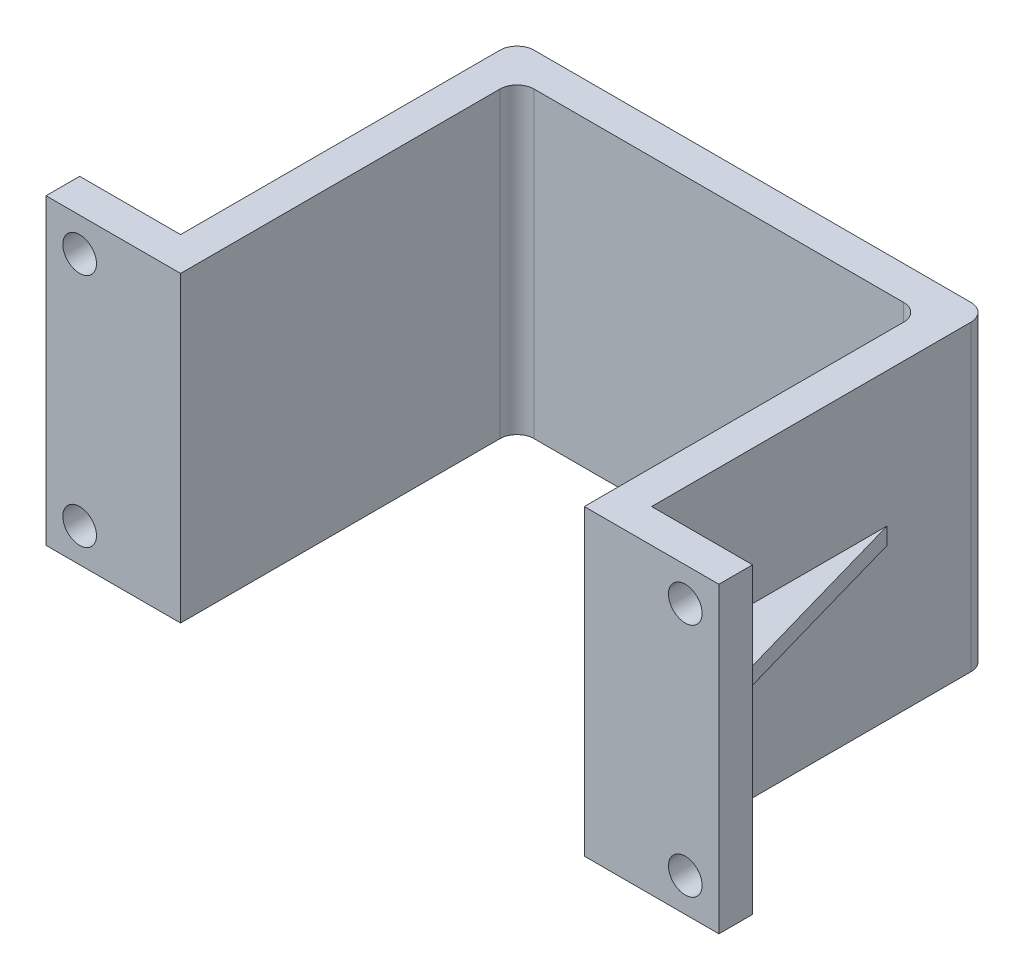
ISO-10303-21;
HEADER;
FILE_DESCRIPTION(('STEP AP214'),'2;1');
FILE_NAME('part.step','',(''),(''),'','','');
FILE_SCHEMA(('AUTOMOTIVE_DESIGN { 1 0 10303 214 1 1 1 1 }'));
ENDSEC;
DATA;
#1=APPLICATION_CONTEXT('core data for automotive mechanical design processes');
#2=APPLICATION_PROTOCOL_DEFINITION('international standard','automotive_design',2000,#1);
#3=PRODUCT_CONTEXT('',#1,'mechanical');
#4=PRODUCT('Part','Part','',(#3));
#5=PRODUCT_RELATED_PRODUCT_CATEGORY('part','',(#4));
#6=PRODUCT_DEFINITION_FORMATION('','',#4);
#7=PRODUCT_DEFINITION_CONTEXT('part definition',#1,'design');
#8=PRODUCT_DEFINITION('design','',#6,#7);
#9=PRODUCT_DEFINITION_SHAPE('','',#8);
#10=(LENGTH_UNIT() NAMED_UNIT(*) SI_UNIT(.MILLI.,.METRE.));
#11=(NAMED_UNIT(*) PLANE_ANGLE_UNIT() SI_UNIT($,.RADIAN.));
#12=(NAMED_UNIT(*) SI_UNIT($,.STERADIAN.) SOLID_ANGLE_UNIT());
#13=UNCERTAINTY_MEASURE_WITH_UNIT(LENGTH_MEASURE(1.E-05),#10,'distance_accuracy_value','');
#14=(GEOMETRIC_REPRESENTATION_CONTEXT(3) GLOBAL_UNCERTAINTY_ASSIGNED_CONTEXT((#13)) GLOBAL_UNIT_ASSIGNED_CONTEXT((#10,
#11,#12)) REPRESENTATION_CONTEXT('',''));
#15=CARTESIAN_POINT('',(0.,0.,0.));
#16=DIRECTION('',(0.,0.,1.));
#17=DIRECTION('',(1.,0.,0.));
#18=AXIS2_PLACEMENT_3D('',#15,#16,#17);
#19=CARTESIAN_POINT('',(13.,9.,-1.508));
#20=DIRECTION('',(-1.,0.,0.));
#21=DIRECTION('',(0.,0.,1.));
#22=AXIS2_PLACEMENT_3D('',#19,#20,#21);
#23=PLANE('',#22);
#24=DIRECTION('',(0.,0.,1.));
#25=VECTOR('',#24,1.);
#26=CARTESIAN_POINT('',(13.,5.00000011,-8.));
#27=LINE('',#26,#25);
#28=CARTESIAN_POINT('',(13.,5.00000011,-8.));
#29=VERTEX_POINT('',#28);
#30=CARTESIAN_POINT('',(13.,5.00000011,-1.));
#31=VERTEX_POINT('',#30);
#32=EDGE_CURVE('E193',#29,#31,#27,.T.);
#33=ORIENTED_EDGE('',*,*,#32,.F.);
#34=DIRECTION('',(0.,-1.,0.));
#35=VECTOR('',#34,1.);
#36=CARTESIAN_POINT('',(13.,5.00000011,-8.));
#37=LINE('',#36,#35);
#38=CARTESIAN_POINT('',(13.,4.50000011,-8.));
#39=VERTEX_POINT('',#38);
#40=EDGE_CURVE('E202',#29,#39,#37,.T.);
#41=ORIENTED_EDGE('',*,*,#40,.T.);
#42=DIRECTION('',(0.,0.,1.));
#43=VECTOR('',#42,1.);
#44=CARTESIAN_POINT('',(13.,4.50000011,-8.));
#45=LINE('',#44,#43);
#46=CARTESIAN_POINT('',(13.,4.50000011,-1.));
#47=VERTEX_POINT('',#46);
#48=EDGE_CURVE('E218',#39,#47,#45,.T.);
#49=ORIENTED_EDGE('',*,*,#48,.T.);
#50=DIRECTION('',(0.,-1.,0.));
#51=VECTOR('',#50,1.);
#52=CARTESIAN_POINT('',(13.,9.,-1.));
#53=LINE('',#52,#51);
#54=CARTESIAN_POINT('',(13.,0.,-1.));
#55=VERTEX_POINT('',#54);
#56=EDGE_CURVE('E48',#47,#55,#53,.T.);
#57=ORIENTED_EDGE('',*,*,#56,.T.);
#58=DIRECTION('',(0.,0.,-1.));
#59=VECTOR('',#58,1.);
#60=CARTESIAN_POINT('',(13.,0.,-1.508));
#61=LINE('',#60,#59);
#62=CARTESIAN_POINT('',(13.,0.,-10.492));
#63=VERTEX_POINT('',#62);
#64=EDGE_CURVE('E328',#55,#63,#61,.T.);
#65=ORIENTED_EDGE('',*,*,#64,.T.);
#66=DIRECTION('',(0.,-1.,0.));
#67=VECTOR('',#66,1.);
#68=CARTESIAN_POINT('',(13.,9.,-10.492));
#69=LINE('',#68,#67);
#70=CARTESIAN_POINT('',(13.,9.,-10.492));
#71=VERTEX_POINT('',#70);
#72=EDGE_CURVE('E438',#71,#63,#69,.T.);
#73=ORIENTED_EDGE('',*,*,#72,.F.);
#74=DIRECTION('',(0.,0.,-1.));
#75=VECTOR('',#74,1.);
#76=CARTESIAN_POINT('',(13.,9.,-1.508));
#77=LINE('',#76,#75);
#78=CARTESIAN_POINT('',(13.,9.,-1.));
#79=VERTEX_POINT('',#78);
#80=EDGE_CURVE('E280',#79,#71,#77,.T.);
#81=ORIENTED_EDGE('',*,*,#80,.F.);
#82=EDGE_CURVE('E11',#79,#31,#53,.T.);
#83=ORIENTED_EDGE('',*,*,#82,.T.);
#84=EDGE_LOOP('',(#33,#41,#49,#57,#65,#73,#81,#83));
#85=FACE_BOUND('',#84,.T.);
#86=ADVANCED_FACE('F39',(#85),#23,.F.);
#87=CARTESIAN_POINT('',(13.508,9.,-1.));
#88=DIRECTION('',(0.,0.,1.));
#89=DIRECTION('',(1.,0.,0.));
#90=AXIS2_PLACEMENT_3D('',#87,#88,#89);
#91=PLANE('',#90);
#92=CARTESIAN_POINT('',(15.,8.,-1.));
#93=DIRECTION('',(0.,0.,-1.));
#94=DIRECTION('',(-1.,0.,0.));
#95=AXIS2_PLACEMENT_3D('',#92,#93,#94);
#96=CIRCLE('',#95,0.500000000000001);
#97=CARTESIAN_POINT('',(14.5,8.,-1.));
#98=VERTEX_POINT('',#97);
#99=EDGE_CURVE('E251',#98,#98,#96,.T.);
#100=ORIENTED_EDGE('',*,*,#99,.F.);
#101=EDGE_LOOP('',(#100));
#102=FACE_BOUND('',#101,.T.);
#103=CARTESIAN_POINT('',(15.,0.999999999999999,-1.));
#104=DIRECTION('',(0.,0.,-1.));
#105=DIRECTION('',(-1.,0.,0.));
#106=AXIS2_PLACEMENT_3D('',#103,#104,#105);
#107=CIRCLE('',#106,0.500000000000001);
#108=CARTESIAN_POINT('',(14.5,0.999999999999999,-1.));
#109=VERTEX_POINT('',#108);
#110=EDGE_CURVE('E255',#109,#109,#107,.T.);
#111=ORIENTED_EDGE('',*,*,#110,.F.);
#112=EDGE_LOOP('',(#111));
#113=FACE_BOUND('',#112,.T.);
#114=DIRECTION('',(1.,0.,0.));
#115=VECTOR('',#114,1.);
#116=CARTESIAN_POINT('',(13.,5.00000011,-1.));
#117=LINE('',#116,#115);
#118=CARTESIAN_POINT('',(15.,5.00000011,-1.));
#119=VERTEX_POINT('',#118);
#120=EDGE_CURVE('E195',#31,#119,#117,.T.);
#121=ORIENTED_EDGE('',*,*,#120,.F.);
#122=ORIENTED_EDGE('',*,*,#82,.F.);
#123=DIRECTION('',(-1.,0.,0.));
#124=VECTOR('',#123,1.);
#125=CARTESIAN_POINT('',(13.,9.,-1.));
#126=LINE('',#125,#124);
#127=CARTESIAN_POINT('',(16.,9.,-1.));
#128=VERTEX_POINT('',#127);
#129=EDGE_CURVE('E276',#128,#79,#126,.T.);
#130=ORIENTED_EDGE('',*,*,#129,.F.);
#131=DIRECTION('',(0.,-1.,0.));
#132=VECTOR('',#131,1.);
#133=CARTESIAN_POINT('',(16.,9.,-1.));
#134=LINE('',#133,#132);
#135=CARTESIAN_POINT('',(16.,0.,-1.));
#136=VERTEX_POINT('',#135);
#137=EDGE_CURVE('E327',#128,#136,#134,.T.);
#138=ORIENTED_EDGE('',*,*,#137,.T.);
#139=DIRECTION('',(-1.,0.,0.));
#140=VECTOR('',#139,1.);
#141=CARTESIAN_POINT('',(13.508,0.,-1.));
#142=LINE('',#141,#140);
#143=EDGE_CURVE('E281',#136,#55,#142,.T.);
#144=ORIENTED_EDGE('',*,*,#143,.T.);
#145=ORIENTED_EDGE('',*,*,#56,.F.);
#146=DIRECTION('',(1.,0.,0.));
#147=VECTOR('',#146,1.);
#148=CARTESIAN_POINT('',(13.,4.50000011,-1.));
#149=LINE('',#148,#147);
#150=CARTESIAN_POINT('',(15.,4.50000011,-1.));
#151=VERTEX_POINT('',#150);
#152=EDGE_CURVE('E199',#47,#151,#149,.T.);
#153=ORIENTED_EDGE('',*,*,#152,.T.);
#154=DIRECTION('',(0.,-1.,0.));
#155=VECTOR('',#154,1.);
#156=CARTESIAN_POINT('',(15.,5.00000011,-1.));
#157=LINE('',#156,#155);
#158=EDGE_CURVE('E208',#119,#151,#157,.T.);
#159=ORIENTED_EDGE('',*,*,#158,.F.);
#160=EDGE_LOOP('',(#121,#122,#130,#138,#144,#145,#153,#159));
#161=FACE_BOUND('',#160,.T.);
#162=ADVANCED_FACE('F470',(#102,#113,#161),#91,.F.);
#163=CARTESIAN_POINT('',(12.492,9.,-10.492));
#164=DIRECTION('',(0.,-1.,0.));
#165=DIRECTION('',(0.,0.,-1.));
#166=AXIS2_PLACEMENT_3D('',#163,#164,#165);
#167=CYLINDRICAL_SURFACE('',#166,0.508);
#168=CARTESIAN_POINT('',(12.492,0.,-10.492));
#169=DIRECTION('',(0.,1.,0.));
#170=DIRECTION('',(0.,0.,-1.));
#171=AXIS2_PLACEMENT_3D('',#168,#169,#170);
#172=CIRCLE('',#171,0.508);
#173=CARTESIAN_POINT('',(12.492,0.,-11.));
#174=VERTEX_POINT('',#173);
#175=EDGE_CURVE('E331',#63,#174,#172,.T.);
#176=ORIENTED_EDGE('',*,*,#175,.T.);
#177=DIRECTION('',(0.,-1.,0.));
#178=VECTOR('',#177,1.);
#179=CARTESIAN_POINT('',(12.492,9.,-11.));
#180=LINE('',#179,#178);
#181=CARTESIAN_POINT('',(12.492,9.,-11.));
#182=VERTEX_POINT('',#181);
#183=EDGE_CURVE('E434',#182,#174,#180,.T.);
#184=ORIENTED_EDGE('',*,*,#183,.F.);
#185=CARTESIAN_POINT('',(12.492,9.,-10.492));
#186=DIRECTION('',(0.,1.,0.));
#187=DIRECTION('',(0.,0.,-1.));
#188=AXIS2_PLACEMENT_3D('',#185,#186,#187);
#189=CIRCLE('',#188,0.508);
#190=EDGE_CURVE('E284',#71,#182,#189,.T.);
#191=ORIENTED_EDGE('',*,*,#190,.F.);
#192=ORIENTED_EDGE('',*,*,#72,.T.);
#193=EDGE_LOOP('',(#176,#184,#191,#192));
#194=FACE_BOUND('',#193,.T.);
#195=ADVANCED_FACE('F474',(#194),#167,.T.);
#196=CARTESIAN_POINT('',(-0.491999999999997,9.,-11.));
#197=DIRECTION('',(0.,0.,1.));
#198=DIRECTION('',(1.,0.,0.));
#199=AXIS2_PLACEMENT_3D('',#196,#197,#198);
#200=PLANE('',#199);
#201=DIRECTION('',(-1.,0.,0.));
#202=VECTOR('',#201,1.);
#203=CARTESIAN_POINT('',(-0.491999999999997,0.,-11.));
#204=LINE('',#203,#202);
#205=CARTESIAN_POINT('',(-0.491999999999997,0.,-11.));
#206=VERTEX_POINT('',#205);
#207=EDGE_CURVE('E334',#174,#206,#204,.T.);
#208=ORIENTED_EDGE('',*,*,#207,.T.);
#209=DIRECTION('',(0.,-1.,0.));
#210=VECTOR('',#209,1.);
#211=CARTESIAN_POINT('',(-0.491999999999997,9.,-11.));
#212=LINE('',#211,#210);
#213=CARTESIAN_POINT('',(-0.491999999999997,9.,-11.));
#214=VERTEX_POINT('',#213);
#215=EDGE_CURVE('E430',#214,#206,#212,.T.);
#216=ORIENTED_EDGE('',*,*,#215,.F.);
#217=DIRECTION('',(-1.,0.,0.));
#218=VECTOR('',#217,1.);
#219=CARTESIAN_POINT('',(-0.491999999999997,9.,-11.));
#220=LINE('',#219,#218);
#221=EDGE_CURVE('E287',#182,#214,#220,.T.);
#222=ORIENTED_EDGE('',*,*,#221,.F.);
#223=ORIENTED_EDGE('',*,*,#183,.T.);
#224=EDGE_LOOP('',(#208,#216,#222,#223));
#225=FACE_BOUND('',#224,.T.);
#226=ADVANCED_FACE('F480',(#225),#200,.F.);
#227=CARTESIAN_POINT('',(-0.492,9.,-10.492));
#228=DIRECTION('',(0.,-1.,0.));
#229=DIRECTION('',(0.,0.,-1.));
#230=AXIS2_PLACEMENT_3D('',#227,#228,#229);
#231=CYLINDRICAL_SURFACE('',#230,0.508);
#232=CARTESIAN_POINT('',(-0.492,0.,-10.492));
#233=DIRECTION('',(0.,1.,0.));
#234=DIRECTION('',(0.,0.,-1.));
#235=AXIS2_PLACEMENT_3D('',#232,#233,#234);
#236=CIRCLE('',#235,0.508);
#237=CARTESIAN_POINT('',(-1.,0.,-10.492));
#238=VERTEX_POINT('',#237);
#239=EDGE_CURVE('E337',#206,#238,#236,.T.);
#240=ORIENTED_EDGE('',*,*,#239,.T.);
#241=DIRECTION('',(0.,-1.,0.));
#242=VECTOR('',#241,1.);
#243=CARTESIAN_POINT('',(-1.,9.,-10.492));
#244=LINE('',#243,#242);
#245=CARTESIAN_POINT('',(-1.,9.,-10.492));
#246=VERTEX_POINT('',#245);
#247=EDGE_CURVE('E426',#246,#238,#244,.T.);
#248=ORIENTED_EDGE('',*,*,#247,.F.);
#249=CARTESIAN_POINT('',(-0.492,9.,-10.492));
#250=DIRECTION('',(0.,1.,0.));
#251=DIRECTION('',(0.,0.,-1.));
#252=AXIS2_PLACEMENT_3D('',#249,#250,#251);
#253=CIRCLE('',#252,0.508);
#254=EDGE_CURVE('E290',#214,#246,#253,.T.);
#255=ORIENTED_EDGE('',*,*,#254,.F.);
#256=ORIENTED_EDGE('',*,*,#215,.T.);
#257=EDGE_LOOP('',(#240,#248,#255,#256));
#258=FACE_BOUND('',#257,.T.);
#259=ADVANCED_FACE('F530',(#258),#231,.T.);
#260=CARTESIAN_POINT('',(-1.,9.,-1.508));
#261=DIRECTION('',(1.,0.,0.));
#262=DIRECTION('',(0.,0.,-1.));
#263=AXIS2_PLACEMENT_3D('',#260,#261,#262);
#264=PLANE('',#263);
#265=DIRECTION('',(0.,-1.,0.));
#266=VECTOR('',#265,1.);
#267=CARTESIAN_POINT('',(-1.,5.00000011,-8.));
#268=LINE('',#267,#266);
#269=CARTESIAN_POINT('',(-1.,5.00000011,-8.));
#270=VERTEX_POINT('',#269);
#271=CARTESIAN_POINT('',(-1.,4.50000011,-8.));
#272=VERTEX_POINT('',#271);
#273=EDGE_CURVE('E64',#270,#272,#268,.T.);
#274=ORIENTED_EDGE('',*,*,#273,.F.);
#275=DIRECTION('',(0.,0.,-1.));
#276=VECTOR('',#275,1.);
#277=CARTESIAN_POINT('',(-1.,5.00000011,-8.));
#278=LINE('',#277,#276);
#279=CARTESIAN_POINT('',(-1.,5.00000011,-1.));
#280=VERTEX_POINT('',#279);
#281=EDGE_CURVE('E230',#280,#270,#278,.T.);
#282=ORIENTED_EDGE('',*,*,#281,.F.);
#283=DIRECTION('',(0.,-1.,0.));
#284=VECTOR('',#283,1.);
#285=CARTESIAN_POINT('',(-1.,9.,-1.));
#286=LINE('',#285,#284);
#287=CARTESIAN_POINT('',(-1.,9.,-1.));
#288=VERTEX_POINT('',#287);
#289=EDGE_CURVE('E422',#288,#280,#286,.T.);
#290=ORIENTED_EDGE('',*,*,#289,.F.);
#291=DIRECTION('',(0.,0.,1.));
#292=VECTOR('',#291,1.);
#293=CARTESIAN_POINT('',(-1.,9.,-1.508));
#294=LINE('',#293,#292);
#295=EDGE_CURVE('E293',#246,#288,#294,.T.);
#296=ORIENTED_EDGE('',*,*,#295,.F.);
#297=ORIENTED_EDGE('',*,*,#247,.T.);
#298=DIRECTION('',(0.,0.,1.));
#299=VECTOR('',#298,1.);
#300=CARTESIAN_POINT('',(-1.,0.,-1.508));
#301=LINE('',#300,#299);
#302=CARTESIAN_POINT('',(-1.,0.,-1.));
#303=VERTEX_POINT('',#302);
#304=EDGE_CURVE('E341',#238,#303,#301,.T.);
#305=ORIENTED_EDGE('',*,*,#304,.T.);
#306=CARTESIAN_POINT('',(-1.,4.50000011,-1.));
#307=VERTEX_POINT('',#306);
#308=EDGE_CURVE('E421',#307,#303,#286,.T.);
#309=ORIENTED_EDGE('',*,*,#308,.F.);
#310=DIRECTION('',(0.,0.,-1.));
#311=VECTOR('',#310,1.);
#312=CARTESIAN_POINT('',(-1.,4.50000011,-8.));
#313=LINE('',#312,#311);
#314=EDGE_CURVE('E241',#307,#272,#313,.T.);
#315=ORIENTED_EDGE('',*,*,#314,.T.);
#316=EDGE_LOOP('',(#274,#282,#290,#296,#297,#305,#309,#315));
#317=FACE_BOUND('',#316,.T.);
#318=ADVANCED_FACE('F526',(#317),#264,.F.);
#319=CARTESIAN_POINT('',(-1.508,9.,-1.));
#320=DIRECTION('',(0.,0.,1.));
#321=DIRECTION('',(1.,0.,0.));
#322=AXIS2_PLACEMENT_3D('',#319,#320,#321);
#323=PLANE('',#322);
#324=CARTESIAN_POINT('',(-3.,8.,-1.));
#325=DIRECTION('',(0.,0.,-1.));
#326=DIRECTION('',(-1.,0.,0.));
#327=AXIS2_PLACEMENT_3D('',#324,#325,#326);
#328=CIRCLE('',#327,0.5);
#329=CARTESIAN_POINT('',(-3.5,8.,-1.));
#330=VERTEX_POINT('',#329);
#331=EDGE_CURVE('E256',#330,#330,#328,.T.);
#332=ORIENTED_EDGE('',*,*,#331,.F.);
#333=EDGE_LOOP('',(#332));
#334=FACE_BOUND('',#333,.T.);
#335=CARTESIAN_POINT('',(-3.,0.999999999999999,-1.));
#336=DIRECTION('',(0.,0.,-1.));
#337=DIRECTION('',(-1.,0.,0.));
#338=AXIS2_PLACEMENT_3D('',#335,#336,#337);
#339=CIRCLE('',#338,0.5);
#340=CARTESIAN_POINT('',(-3.5,0.999999999999999,-1.));
#341=VERTEX_POINT('',#340);
#342=EDGE_CURVE('E260',#341,#341,#339,.T.);
#343=ORIENTED_EDGE('',*,*,#342,.F.);
#344=EDGE_LOOP('',(#343));
#345=FACE_BOUND('',#344,.T.);
#346=ORIENTED_EDGE('',*,*,#289,.T.);
#347=DIRECTION('',(1.,0.,0.));
#348=VECTOR('',#347,1.);
#349=CARTESIAN_POINT('',(-1.,5.00000011,-1.));
#350=LINE('',#349,#348);
#351=CARTESIAN_POINT('',(-3.,5.00000011,-1.));
#352=VERTEX_POINT('',#351);
#353=EDGE_CURVE('E226',#352,#280,#350,.T.);
#354=ORIENTED_EDGE('',*,*,#353,.F.);
#355=DIRECTION('',(0.,-1.,0.));
#356=VECTOR('',#355,1.);
#357=CARTESIAN_POINT('',(-3.,5.00000011,-1.));
#358=LINE('',#357,#356);
#359=CARTESIAN_POINT('',(-3.,4.50000011,-1.));
#360=VERTEX_POINT('',#359);
#361=EDGE_CURVE('E238',#352,#360,#358,.T.);
#362=ORIENTED_EDGE('',*,*,#361,.T.);
#363=DIRECTION('',(1.,0.,0.));
#364=VECTOR('',#363,1.);
#365=CARTESIAN_POINT('',(-1.,4.50000011,-1.));
#366=LINE('',#365,#364);
#367=EDGE_CURVE('E207',#360,#307,#366,.T.);
#368=ORIENTED_EDGE('',*,*,#367,.T.);
#369=ORIENTED_EDGE('',*,*,#308,.T.);
#370=DIRECTION('',(-1.,0.,0.));
#371=VECTOR('',#370,1.);
#372=CARTESIAN_POINT('',(-1.508,0.,-1.));
#373=LINE('',#372,#371);
#374=CARTESIAN_POINT('',(-4.,0.,-1.));
#375=VERTEX_POINT('',#374);
#376=EDGE_CURVE('E345',#303,#375,#373,.T.);
#377=ORIENTED_EDGE('',*,*,#376,.T.);
#378=DIRECTION('',(0.,-1.,0.));
#379=VECTOR('',#378,1.);
#380=CARTESIAN_POINT('',(-4.,9.,-1.));
#381=LINE('',#380,#379);
#382=CARTESIAN_POINT('',(-4.,9.,-1.));
#383=VERTEX_POINT('',#382);
#384=EDGE_CURVE('E417',#383,#375,#381,.T.);
#385=ORIENTED_EDGE('',*,*,#384,.F.);
#386=DIRECTION('',(-1.,0.,0.));
#387=VECTOR('',#386,1.);
#388=CARTESIAN_POINT('',(-1.,9.,-1.));
#389=LINE('',#388,#387);
#390=EDGE_CURVE('E296',#288,#383,#389,.T.);
#391=ORIENTED_EDGE('',*,*,#390,.F.);
#392=EDGE_LOOP('',(#346,#354,#362,#368,#369,#377,#385,#391));
#393=FACE_BOUND('',#392,.T.);
#394=ADVANCED_FACE('F522',(#334,#345,#393),#323,.F.);
#395=CARTESIAN_POINT('',(-4.,9.,0.));
#396=DIRECTION('',(1.,0.,0.));
#397=DIRECTION('',(0.,0.,-1.));
#398=AXIS2_PLACEMENT_3D('',#395,#396,#397);
#399=PLANE('',#398);
#400=DIRECTION('',(0.,0.,1.));
#401=VECTOR('',#400,1.);
#402=CARTESIAN_POINT('',(-4.,0.,0.));
#403=LINE('',#402,#401);
#404=CARTESIAN_POINT('',(-4.,0.,0.));
#405=VERTEX_POINT('',#404);
#406=EDGE_CURVE('E348',#375,#405,#403,.T.);
#407=ORIENTED_EDGE('',*,*,#406,.T.);
#408=DIRECTION('',(0.,-1.,0.));
#409=VECTOR('',#408,1.);
#410=CARTESIAN_POINT('',(-4.,9.,0.));
#411=LINE('',#410,#409);
#412=CARTESIAN_POINT('',(-4.,9.,0.));
#413=VERTEX_POINT('',#412);
#414=EDGE_CURVE('E413',#413,#405,#411,.T.);
#415=ORIENTED_EDGE('',*,*,#414,.F.);
#416=DIRECTION('',(0.,0.,1.));
#417=VECTOR('',#416,1.);
#418=CARTESIAN_POINT('',(-4.,9.,0.));
#419=LINE('',#418,#417);
#420=EDGE_CURVE('E299',#383,#413,#419,.T.);
#421=ORIENTED_EDGE('',*,*,#420,.F.);
#422=ORIENTED_EDGE('',*,*,#384,.T.);
#423=EDGE_LOOP('',(#407,#415,#421,#422));
#424=FACE_BOUND('',#423,.T.);
#425=ADVANCED_FACE('F519',(#424),#399,.F.);
#426=CARTESIAN_POINT('',(-0.508000000000003,9.,0.));
#427=DIRECTION('',(0.,0.,-1.));
#428=DIRECTION('',(-1.,0.,0.));
#429=AXIS2_PLACEMENT_3D('',#426,#427,#428);
#430=PLANE('',#429);
#431=CARTESIAN_POINT('',(-3.,8.,0.));
#432=DIRECTION('',(0.,0.,-1.));
#433=DIRECTION('',(-1.,0.,0.));
#434=AXIS2_PLACEMENT_3D('',#431,#432,#433);
#435=CIRCLE('',#434,0.5);
#436=CARTESIAN_POINT('',(-3.5,8.,0.));
#437=VERTEX_POINT('',#436);
#438=EDGE_CURVE('E42',#437,#437,#435,.T.);
#439=ORIENTED_EDGE('',*,*,#438,.T.);
#440=EDGE_LOOP('',(#439));
#441=FACE_BOUND('',#440,.T.);
#442=CARTESIAN_POINT('',(-3.,0.999999999999999,0.));
#443=DIRECTION('',(0.,0.,-1.));
#444=DIRECTION('',(-1.,0.,0.));
#445=AXIS2_PLACEMENT_3D('',#442,#443,#444);
#446=CIRCLE('',#445,0.5);
#447=CARTESIAN_POINT('',(-3.5,0.999999999999999,0.));
#448=VERTEX_POINT('',#447);
#449=EDGE_CURVE('E275',#448,#448,#446,.T.);
#450=ORIENTED_EDGE('',*,*,#449,.T.);
#451=EDGE_LOOP('',(#450));
#452=FACE_BOUND('',#451,.T.);
#453=DIRECTION('',(1.,0.,0.));
#454=VECTOR('',#453,1.);
#455=CARTESIAN_POINT('',(-0.508000000000003,0.,0.));
#456=LINE('',#455,#454);
#457=CARTESIAN_POINT('',(0.,0.,0.));
#458=VERTEX_POINT('',#457);
#459=EDGE_CURVE('E352',#405,#458,#456,.T.);
#460=ORIENTED_EDGE('',*,*,#459,.T.);
#461=DIRECTION('',(0.,-1.,0.));
#462=VECTOR('',#461,1.);
#463=CARTESIAN_POINT('',(0.,9.,0.));
#464=LINE('',#463,#462);
#465=CARTESIAN_POINT('',(0.,9.,0.));
#466=VERTEX_POINT('',#465);
#467=EDGE_CURVE('E409',#466,#458,#464,.T.);
#468=ORIENTED_EDGE('',*,*,#467,.F.);
#469=DIRECTION('',(1.,0.,0.));
#470=VECTOR('',#469,1.);
#471=CARTESIAN_POINT('',(-0.904522613065325,9.,0.));
#472=LINE('',#471,#470);
#473=EDGE_CURVE('E302',#413,#466,#472,.T.);
#474=ORIENTED_EDGE('',*,*,#473,.F.);
#475=ORIENTED_EDGE('',*,*,#414,.T.);
#476=EDGE_LOOP('',(#460,#468,#474,#475));
#477=FACE_BOUND('',#476,.T.);
#478=ADVANCED_FACE('F449',(#441,#452,#477),#430,.F.);
#479=CARTESIAN_POINT('',(0.,9.,-0.508000000000004));
#480=DIRECTION('',(-1.,0.,0.));
#481=DIRECTION('',(0.,0.,1.));
#482=AXIS2_PLACEMENT_3D('',#479,#480,#481);
#483=PLANE('',#482);
#484=DIRECTION('',(0.,0.,-1.));
#485=VECTOR('',#484,1.);
#486=CARTESIAN_POINT('',(0.,0.,-0.508000000000004));
#487=LINE('',#486,#485);
#488=CARTESIAN_POINT('',(0.,0.,-9.492));
#489=VERTEX_POINT('',#488);
#490=EDGE_CURVE('E356',#458,#489,#487,.T.);
#491=ORIENTED_EDGE('',*,*,#490,.T.);
#492=DIRECTION('',(0.,-1.,0.));
#493=VECTOR('',#492,1.);
#494=CARTESIAN_POINT('',(0.,9.,-9.492));
#495=LINE('',#494,#493);
#496=CARTESIAN_POINT('',(0.,9.,-9.492));
#497=VERTEX_POINT('',#496);
#498=EDGE_CURVE('E405',#497,#489,#495,.T.);
#499=ORIENTED_EDGE('',*,*,#498,.F.);
#500=DIRECTION('',(0.,0.,-1.));
#501=VECTOR('',#500,1.);
#502=CARTESIAN_POINT('',(0.,9.,0.));
#503=LINE('',#502,#501);
#504=EDGE_CURVE('E305',#466,#497,#503,.T.);
#505=ORIENTED_EDGE('',*,*,#504,.F.);
#506=ORIENTED_EDGE('',*,*,#467,.T.);
#507=EDGE_LOOP('',(#491,#499,#505,#506));
#508=FACE_BOUND('',#507,.T.);
#509=ADVANCED_FACE('F512',(#508),#483,.F.);
#510=CARTESIAN_POINT('',(0.508,9.,-9.492));
#511=DIRECTION('',(0.,-1.,0.));
#512=DIRECTION('',(0.,0.,-1.));
#513=AXIS2_PLACEMENT_3D('',#510,#511,#512);
#514=CYLINDRICAL_SURFACE('',#513,0.508);
#515=CARTESIAN_POINT('',(0.508,0.,-9.492));
#516=DIRECTION('',(0.,-1.,0.));
#517=DIRECTION('',(0.,0.,-1.));
#518=AXIS2_PLACEMENT_3D('',#515,#516,#517);
#519=CIRCLE('',#518,0.508);
#520=CARTESIAN_POINT('',(0.508,0.,-10.));
#521=VERTEX_POINT('',#520);
#522=EDGE_CURVE('E359',#489,#521,#519,.T.);
#523=ORIENTED_EDGE('',*,*,#522,.T.);
#524=DIRECTION('',(0.,-1.,0.));
#525=VECTOR('',#524,1.);
#526=CARTESIAN_POINT('',(0.508,9.,-10.));
#527=LINE('',#526,#525);
#528=CARTESIAN_POINT('',(0.508,9.,-10.));
#529=VERTEX_POINT('',#528);
#530=EDGE_CURVE('E401',#529,#521,#527,.T.);
#531=ORIENTED_EDGE('',*,*,#530,.F.);
#532=CARTESIAN_POINT('',(0.508,9.,-9.492));
#533=DIRECTION('',(0.,-1.,0.));
#534=DIRECTION('',(0.,0.,-1.));
#535=AXIS2_PLACEMENT_3D('',#532,#533,#534);
#536=CIRCLE('',#535,0.508);
#537=EDGE_CURVE('E308',#497,#529,#536,.T.);
#538=ORIENTED_EDGE('',*,*,#537,.F.);
#539=ORIENTED_EDGE('',*,*,#498,.T.);
#540=EDGE_LOOP('',(#523,#531,#538,#539));
#541=FACE_BOUND('',#540,.T.);
#542=ADVANCED_FACE('F508',(#541),#514,.F.);
#543=CARTESIAN_POINT('',(0.508000000000003,9.,-10.));
#544=DIRECTION('',(0.,0.,-1.));
#545=DIRECTION('',(-1.,0.,0.));
#546=AXIS2_PLACEMENT_3D('',#543,#544,#545);
#547=PLANE('',#546);
#548=DIRECTION('',(1.,0.,0.));
#549=VECTOR('',#548,1.);
#550=CARTESIAN_POINT('',(0.508000000000003,0.,-10.));
#551=LINE('',#550,#549);
#552=CARTESIAN_POINT('',(11.492,0.,-10.));
#553=VERTEX_POINT('',#552);
#554=EDGE_CURVE('E362',#521,#553,#551,.T.);
#555=ORIENTED_EDGE('',*,*,#554,.T.);
#556=DIRECTION('',(0.,-1.,0.));
#557=VECTOR('',#556,1.);
#558=CARTESIAN_POINT('',(11.492,9.,-10.));
#559=LINE('',#558,#557);
#560=CARTESIAN_POINT('',(11.492,9.,-10.));
#561=VERTEX_POINT('',#560);
#562=EDGE_CURVE('E397',#561,#553,#559,.T.);
#563=ORIENTED_EDGE('',*,*,#562,.F.);
#564=DIRECTION('',(1.,0.,0.));
#565=VECTOR('',#564,1.);
#566=CARTESIAN_POINT('',(0.508000000000003,9.,-10.));
#567=LINE('',#566,#565);
#568=EDGE_CURVE('E311',#529,#561,#567,.T.);
#569=ORIENTED_EDGE('',*,*,#568,.F.);
#570=ORIENTED_EDGE('',*,*,#530,.T.);
#571=EDGE_LOOP('',(#555,#563,#569,#570));
#572=FACE_BOUND('',#571,.T.);
#573=ADVANCED_FACE('F504',(#572),#547,.F.);
#574=CARTESIAN_POINT('',(11.492,9.,-9.492));
#575=DIRECTION('',(0.,-1.,0.));
#576=DIRECTION('',(0.,0.,-1.));
#577=AXIS2_PLACEMENT_3D('',#574,#575,#576);
#578=CYLINDRICAL_SURFACE('',#577,0.508);
#579=CARTESIAN_POINT('',(11.492,0.,-9.492));
#580=DIRECTION('',(0.,-1.,0.));
#581=DIRECTION('',(0.,0.,-1.));
#582=AXIS2_PLACEMENT_3D('',#579,#580,#581);
#583=CIRCLE('',#582,0.508);
#584=CARTESIAN_POINT('',(12.,0.,-9.492));
#585=VERTEX_POINT('',#584);
#586=EDGE_CURVE('E365',#553,#585,#583,.T.);
#587=ORIENTED_EDGE('',*,*,#586,.T.);
#588=DIRECTION('',(0.,-1.,0.));
#589=VECTOR('',#588,1.);
#590=CARTESIAN_POINT('',(12.,9.,-9.492));
#591=LINE('',#590,#589);
#592=CARTESIAN_POINT('',(12.,9.,-9.492));
#593=VERTEX_POINT('',#592);
#594=EDGE_CURVE('E393',#593,#585,#591,.T.);
#595=ORIENTED_EDGE('',*,*,#594,.F.);
#596=CARTESIAN_POINT('',(11.492,9.,-9.492));
#597=DIRECTION('',(0.,-1.,0.));
#598=DIRECTION('',(0.,0.,-1.));
#599=AXIS2_PLACEMENT_3D('',#596,#597,#598);
#600=CIRCLE('',#599,0.508);
#601=EDGE_CURVE('E314',#561,#593,#600,.T.);
#602=ORIENTED_EDGE('',*,*,#601,.F.);
#603=ORIENTED_EDGE('',*,*,#562,.T.);
#604=EDGE_LOOP('',(#587,#595,#602,#603));
#605=FACE_BOUND('',#604,.T.);
#606=ADVANCED_FACE('F500',(#605),#578,.F.);
#607=CARTESIAN_POINT('',(12.,9.,-0.508000000000004));
#608=DIRECTION('',(1.,0.,0.));
#609=DIRECTION('',(0.,0.,-1.));
#610=AXIS2_PLACEMENT_3D('',#607,#608,#609);
#611=PLANE('',#610);
#612=DIRECTION('',(0.,0.,1.));
#613=VECTOR('',#612,1.);
#614=CARTESIAN_POINT('',(12.,0.,-0.508000000000004));
#615=LINE('',#614,#613);
#616=CARTESIAN_POINT('',(12.,0.,0.));
#617=VERTEX_POINT('',#616);
#618=EDGE_CURVE('E369',#585,#617,#615,.T.);
#619=ORIENTED_EDGE('',*,*,#618,.T.);
#620=DIRECTION('',(0.,-1.,0.));
#621=VECTOR('',#620,1.);
#622=CARTESIAN_POINT('',(12.,9.,0.));
#623=LINE('',#622,#621);
#624=CARTESIAN_POINT('',(12.,9.,0.));
#625=VERTEX_POINT('',#624);
#626=EDGE_CURVE('E389',#625,#617,#623,.T.);
#627=ORIENTED_EDGE('',*,*,#626,.F.);
#628=DIRECTION('',(0.,0.,1.));
#629=VECTOR('',#628,1.);
#630=CARTESIAN_POINT('',(12.,9.,-0.508000000000004));
#631=LINE('',#630,#629);
#632=EDGE_CURVE('E317',#593,#625,#631,.T.);
#633=ORIENTED_EDGE('',*,*,#632,.F.);
#634=ORIENTED_EDGE('',*,*,#594,.T.);
#635=EDGE_LOOP('',(#619,#627,#633,#634));
#636=FACE_BOUND('',#635,.T.);
#637=ADVANCED_FACE('F496',(#636),#611,.F.);
#638=CARTESIAN_POINT('',(14.2914572864322,9.,0.));
#639=DIRECTION('',(0.,0.,-1.));
#640=DIRECTION('',(-1.,0.,0.));
#641=AXIS2_PLACEMENT_3D('',#638,#639,#640);
#642=PLANE('',#641);
#643=CARTESIAN_POINT('',(15.,0.999999999999999,0.));
#644=DIRECTION('',(0.,0.,-1.));
#645=DIRECTION('',(-1.,0.,0.));
#646=AXIS2_PLACEMENT_3D('',#643,#644,#645);
#647=CIRCLE('',#646,0.500000000000001);
#648=CARTESIAN_POINT('',(14.5,0.999999999999999,0.));
#649=VERTEX_POINT('',#648);
#650=EDGE_CURVE('E271',#649,#649,#647,.T.);
#651=ORIENTED_EDGE('',*,*,#650,.T.);
#652=EDGE_LOOP('',(#651));
#653=FACE_BOUND('',#652,.T.);
#654=CARTESIAN_POINT('',(15.,8.,0.));
#655=DIRECTION('',(0.,0.,-1.));
#656=DIRECTION('',(-1.,0.,0.));
#657=AXIS2_PLACEMENT_3D('',#654,#655,#656);
#658=CIRCLE('',#657,0.500000000000001);
#659=CARTESIAN_POINT('',(14.5,8.,0.));
#660=VERTEX_POINT('',#659);
#661=EDGE_CURVE('E267',#660,#660,#658,.T.);
#662=ORIENTED_EDGE('',*,*,#661,.T.);
#663=EDGE_LOOP('',(#662));
#664=FACE_BOUND('',#663,.T.);
#665=DIRECTION('',(1.,0.,0.));
#666=VECTOR('',#665,1.);
#667=CARTESIAN_POINT('',(14.2914572864322,0.,0.));
#668=LINE('',#667,#666);
#669=CARTESIAN_POINT('',(16.,0.,0.));
#670=VERTEX_POINT('',#669);
#671=EDGE_CURVE('E373',#617,#670,#668,.T.);
#672=ORIENTED_EDGE('',*,*,#671,.T.);
#673=DIRECTION('',(0.,-1.,0.));
#674=VECTOR('',#673,1.);
#675=CARTESIAN_POINT('',(16.,9.,0.));
#676=LINE('',#675,#674);
#677=CARTESIAN_POINT('',(16.,9.,0.));
#678=VERTEX_POINT('',#677);
#679=EDGE_CURVE('E385',#678,#670,#676,.T.);
#680=ORIENTED_EDGE('',*,*,#679,.F.);
#681=DIRECTION('',(1.,0.,0.));
#682=VECTOR('',#681,1.);
#683=CARTESIAN_POINT('',(12.,9.,0.));
#684=LINE('',#683,#682);
#685=EDGE_CURVE('E320',#625,#678,#684,.T.);
#686=ORIENTED_EDGE('',*,*,#685,.F.);
#687=ORIENTED_EDGE('',*,*,#626,.T.);
#688=EDGE_LOOP('',(#672,#680,#686,#687));
#689=FACE_BOUND('',#688,.T.);
#690=ADVANCED_FACE('F492',(#653,#664,#689),#642,.F.);
#691=CARTESIAN_POINT('',(16.,9.,0.));
#692=DIRECTION('',(-1.,0.,0.));
#693=DIRECTION('',(0.,0.,1.));
#694=AXIS2_PLACEMENT_3D('',#691,#692,#693);
#695=PLANE('',#694);
#696=DIRECTION('',(0.,0.,-1.));
#697=VECTOR('',#696,1.);
#698=CARTESIAN_POINT('',(16.,0.,0.));
#699=LINE('',#698,#697);
#700=EDGE_CURVE('E376',#670,#136,#699,.T.);
#701=ORIENTED_EDGE('',*,*,#700,.T.);
#702=ORIENTED_EDGE('',*,*,#137,.F.);
#703=DIRECTION('',(0.,0.,-1.));
#704=VECTOR('',#703,1.);
#705=CARTESIAN_POINT('',(16.,9.,0.));
#706=LINE('',#705,#704);
#707=EDGE_CURVE('E323',#678,#128,#706,.T.);
#708=ORIENTED_EDGE('',*,*,#707,.F.);
#709=ORIENTED_EDGE('',*,*,#679,.T.);
#710=EDGE_LOOP('',(#701,#702,#708,#709));
#711=FACE_BOUND('',#710,.T.);
#712=ADVANCED_FACE('F488',(#711),#695,.F.);
#713=CARTESIAN_POINT('',(11.492,9.,-9.492));
#714=DIRECTION('',(0.,-1.,0.));
#715=DIRECTION('',(0.,0.,-1.));
#716=AXIS2_PLACEMENT_3D('',#713,#714,#715);
#717=PLANE('',#716);
#718=ORIENTED_EDGE('',*,*,#129,.T.);
#719=ORIENTED_EDGE('',*,*,#80,.T.);
#720=ORIENTED_EDGE('',*,*,#190,.T.);
#721=ORIENTED_EDGE('',*,*,#221,.T.);
#722=ORIENTED_EDGE('',*,*,#254,.T.);
#723=ORIENTED_EDGE('',*,*,#295,.T.);
#724=ORIENTED_EDGE('',*,*,#390,.T.);
#725=ORIENTED_EDGE('',*,*,#420,.T.);
#726=ORIENTED_EDGE('',*,*,#473,.T.);
#727=ORIENTED_EDGE('',*,*,#504,.T.);
#728=ORIENTED_EDGE('',*,*,#537,.T.);
#729=ORIENTED_EDGE('',*,*,#568,.T.);
#730=ORIENTED_EDGE('',*,*,#601,.T.);
#731=ORIENTED_EDGE('',*,*,#632,.T.);
#732=ORIENTED_EDGE('',*,*,#685,.T.);
#733=ORIENTED_EDGE('',*,*,#707,.T.);
#734=EDGE_LOOP('',(#718,#719,#720,#721,#722,#723,#724,#725,#726,#727,#728,#729,#730,#731,#732,#733));
#735=FACE_BOUND('',#734,.T.);
#736=ADVANCED_FACE('F491',(#735),#717,.F.);
#737=CARTESIAN_POINT('',(11.492,0.,-9.492));
#738=DIRECTION('',(0.,-1.,0.));
#739=DIRECTION('',(0.,0.,-1.));
#740=AXIS2_PLACEMENT_3D('',#737,#738,#739);
#741=PLANE('',#740);
#742=ORIENTED_EDGE('',*,*,#64,.F.);
#743=ORIENTED_EDGE('',*,*,#143,.F.);
#744=ORIENTED_EDGE('',*,*,#700,.F.);
#745=ORIENTED_EDGE('',*,*,#671,.F.);
#746=ORIENTED_EDGE('',*,*,#618,.F.);
#747=ORIENTED_EDGE('',*,*,#586,.F.);
#748=ORIENTED_EDGE('',*,*,#554,.F.);
#749=ORIENTED_EDGE('',*,*,#522,.F.);
#750=ORIENTED_EDGE('',*,*,#490,.F.);
#751=ORIENTED_EDGE('',*,*,#459,.F.);
#752=ORIENTED_EDGE('',*,*,#406,.F.);
#753=ORIENTED_EDGE('',*,*,#376,.F.);
#754=ORIENTED_EDGE('',*,*,#304,.F.);
#755=ORIENTED_EDGE('',*,*,#239,.F.);
#756=ORIENTED_EDGE('',*,*,#207,.F.);
#757=ORIENTED_EDGE('',*,*,#175,.F.);
#758=EDGE_LOOP('',(#742,#743,#744,#745,#746,#747,#748,#749,#750,#751,#752,#753,#754,#755,#756,#757));
#759=FACE_BOUND('',#758,.T.);
#760=ADVANCED_FACE('F486',(#759),#741,.T.);
#761=CARTESIAN_POINT('',(15.,8.,8.));
#762=DIRECTION('',(0.,0.,-1.));
#763=DIRECTION('',(-1.,0.,0.));
#764=AXIS2_PLACEMENT_3D('',#761,#762,#763);
#765=CYLINDRICAL_SURFACE('',#764,0.500000000000001);
#766=ORIENTED_EDGE('',*,*,#99,.T.);
#767=EDGE_LOOP('',(#766));
#768=FACE_BOUND('',#767,.T.);
#769=ORIENTED_EDGE('',*,*,#661,.F.);
#770=EDGE_LOOP('',(#769));
#771=FACE_BOUND('',#770,.T.);
#772=ADVANCED_FACE('F606',(#768,#771),#765,.F.);
#773=CARTESIAN_POINT('',(15.,0.999999999999999,8.));
#774=DIRECTION('',(0.,0.,-1.));
#775=DIRECTION('',(-1.,0.,0.));
#776=AXIS2_PLACEMENT_3D('',#773,#774,#775);
#777=CYLINDRICAL_SURFACE('',#776,0.500000000000001);
#778=ORIENTED_EDGE('',*,*,#110,.T.);
#779=EDGE_LOOP('',(#778));
#780=FACE_BOUND('',#779,.T.);
#781=ORIENTED_EDGE('',*,*,#650,.F.);
#782=EDGE_LOOP('',(#781));
#783=FACE_BOUND('',#782,.T.);
#784=ADVANCED_FACE('F464',(#780,#783),#777,.F.);
#785=CARTESIAN_POINT('',(-3.,0.999999999999999,8.));
#786=DIRECTION('',(0.,0.,-1.));
#787=DIRECTION('',(-1.,0.,0.));
#788=AXIS2_PLACEMENT_3D('',#785,#786,#787);
#789=CYLINDRICAL_SURFACE('',#788,0.5);
#790=ORIENTED_EDGE('',*,*,#342,.T.);
#791=EDGE_LOOP('',(#790));
#792=FACE_BOUND('',#791,.T.);
#793=ORIENTED_EDGE('',*,*,#449,.F.);
#794=EDGE_LOOP('',(#793));
#795=FACE_BOUND('',#794,.T.);
#796=ADVANCED_FACE('F454',(#792,#795),#789,.F.);
#797=CARTESIAN_POINT('',(-3.,8.,8.));
#798=DIRECTION('',(0.,0.,-1.));
#799=DIRECTION('',(-1.,0.,0.));
#800=AXIS2_PLACEMENT_3D('',#797,#798,#799);
#801=CYLINDRICAL_SURFACE('',#800,0.5);
#802=ORIENTED_EDGE('',*,*,#331,.T.);
#803=EDGE_LOOP('',(#802));
#804=FACE_BOUND('',#803,.T.);
#805=ORIENTED_EDGE('',*,*,#438,.F.);
#806=EDGE_LOOP('',(#805));
#807=FACE_BOUND('',#806,.T.);
#808=ADVANCED_FACE('F451',(#804,#807),#801,.F.);
#809=CARTESIAN_POINT('',(-3.,5.00000011,-1.));
#810=DIRECTION('',(0.961523947640823,0.,0.274721127897378));
#811=DIRECTION('',(0.274721127897378,0.,-0.961523947640823));
#812=AXIS2_PLACEMENT_3D('',#809,#810,#811);
#813=PLANE('',#812);
#814=DIRECTION('',(-0.274721127897378,0.,0.961523947640823));
#815=VECTOR('',#814,1.);
#816=CARTESIAN_POINT('',(-3.,4.50000011,-1.));
#817=LINE('',#816,#815);
#818=EDGE_CURVE('E231',#272,#360,#817,.T.);
#819=ORIENTED_EDGE('',*,*,#818,.T.);
#820=ORIENTED_EDGE('',*,*,#361,.F.);
#821=DIRECTION('',(-0.274721127897378,0.,0.961523947640823));
#822=VECTOR('',#821,1.);
#823=CARTESIAN_POINT('',(-3.,5.00000011,-1.));
#824=LINE('',#823,#822);
#825=EDGE_CURVE('E234',#270,#352,#824,.T.);
#826=ORIENTED_EDGE('',*,*,#825,.F.);
#827=ORIENTED_EDGE('',*,*,#273,.T.);
#828=EDGE_LOOP('',(#819,#820,#826,#827));
#829=FACE_BOUND('',#828,.T.);
#830=ADVANCED_FACE('F453',(#829),#813,.F.);
#831=CARTESIAN_POINT('',(0.,5.00000011,0.));
#832=DIRECTION('',(0.,1.,0.));
#833=DIRECTION('',(0.,0.,1.));
#834=AXIS2_PLACEMENT_3D('',#831,#832,#833);
#835=PLANE('',#834);
#836=ORIENTED_EDGE('',*,*,#353,.T.);
#837=ORIENTED_EDGE('',*,*,#281,.T.);
#838=ORIENTED_EDGE('',*,*,#825,.T.);
#839=EDGE_LOOP('',(#836,#837,#838));
#840=FACE_BOUND('',#839,.T.);
#841=ADVANCED_FACE('F461',(#840),#835,.T.);
#842=CARTESIAN_POINT('',(0.,4.50000011,0.));
#843=DIRECTION('',(0.,1.,0.));
#844=DIRECTION('',(0.,0.,1.));
#845=AXIS2_PLACEMENT_3D('',#842,#843,#844);
#846=PLANE('',#845);
#847=ORIENTED_EDGE('',*,*,#367,.F.);
#848=ORIENTED_EDGE('',*,*,#818,.F.);
#849=ORIENTED_EDGE('',*,*,#314,.F.);
#850=EDGE_LOOP('',(#847,#848,#849));
#851=FACE_BOUND('',#850,.T.);
#852=ADVANCED_FACE('F600',(#851),#846,.F.);
#853=CARTESIAN_POINT('',(15.,5.00000011,-1.));
#854=DIRECTION('',(-0.961523947640823,0.,0.274721127897378));
#855=DIRECTION('',(0.274721127897378,0.,0.961523947640823));
#856=AXIS2_PLACEMENT_3D('',#853,#854,#855);
#857=PLANE('',#856);
#858=DIRECTION('',(-0.274721127897378,0.,-0.961523947640823));
#859=VECTOR('',#858,1.);
#860=CARTESIAN_POINT('',(15.,4.50000011,-1.));
#861=LINE('',#860,#859);
#862=EDGE_CURVE('E56',#151,#39,#861,.T.);
#863=ORIENTED_EDGE('',*,*,#862,.T.);
#864=ORIENTED_EDGE('',*,*,#40,.F.);
#865=DIRECTION('',(-0.274721127897378,0.,-0.961523947640823));
#866=VECTOR('',#865,1.);
#867=CARTESIAN_POINT('',(15.,5.00000011,-1.));
#868=LINE('',#867,#866);
#869=EDGE_CURVE('E189',#119,#29,#868,.T.);
#870=ORIENTED_EDGE('',*,*,#869,.F.);
#871=ORIENTED_EDGE('',*,*,#158,.T.);
#872=EDGE_LOOP('',(#863,#864,#870,#871));
#873=FACE_BOUND('',#872,.T.);
#874=ADVANCED_FACE('F203',(#873),#857,.F.);
#875=CARTESIAN_POINT('',(0.,5.00000011,0.));
#876=DIRECTION('',(0.,-1.,0.));
#877=DIRECTION('',(0.,0.,-1.));
#878=AXIS2_PLACEMENT_3D('',#875,#876,#877);
#879=PLANE('',#878);
#880=ORIENTED_EDGE('',*,*,#869,.T.);
#881=ORIENTED_EDGE('',*,*,#32,.T.);
#882=ORIENTED_EDGE('',*,*,#120,.T.);
#883=EDGE_LOOP('',(#880,#881,#882));
#884=FACE_BOUND('',#883,.T.);
#885=ADVANCED_FACE('F191',(#884),#879,.F.);
#886=CARTESIAN_POINT('',(0.,4.50000011,0.));
#887=DIRECTION('',(0.,-1.,0.));
#888=DIRECTION('',(0.,0.,-1.));
#889=AXIS2_PLACEMENT_3D('',#886,#887,#888);
#890=PLANE('',#889);
#891=ORIENTED_EDGE('',*,*,#862,.F.);
#892=ORIENTED_EDGE('',*,*,#152,.F.);
#893=ORIENTED_EDGE('',*,*,#48,.F.);
#894=EDGE_LOOP('',(#891,#892,#893));
#895=FACE_BOUND('',#894,.T.);
#896=ADVANCED_FACE('F590',(#895),#890,.T.);
#897=CLOSED_SHELL('',(#86,#162,#195,#226,#259,#318,#394,#425,#478,#509,#542,#573,#606,#637,#690,
#712,#736,#760,#772,#784,#796,#808,#830,#841,#852,#874,#885,#896));
#898=MANIFOLD_SOLID_BREP('B2',#897);
#899=ADVANCED_BREP_SHAPE_REPRESENTATION('',(#18,#898),#14);
#900=SHAPE_DEFINITION_REPRESENTATION(#9,#899);
ENDSEC;
END-ISO-10303-21;
